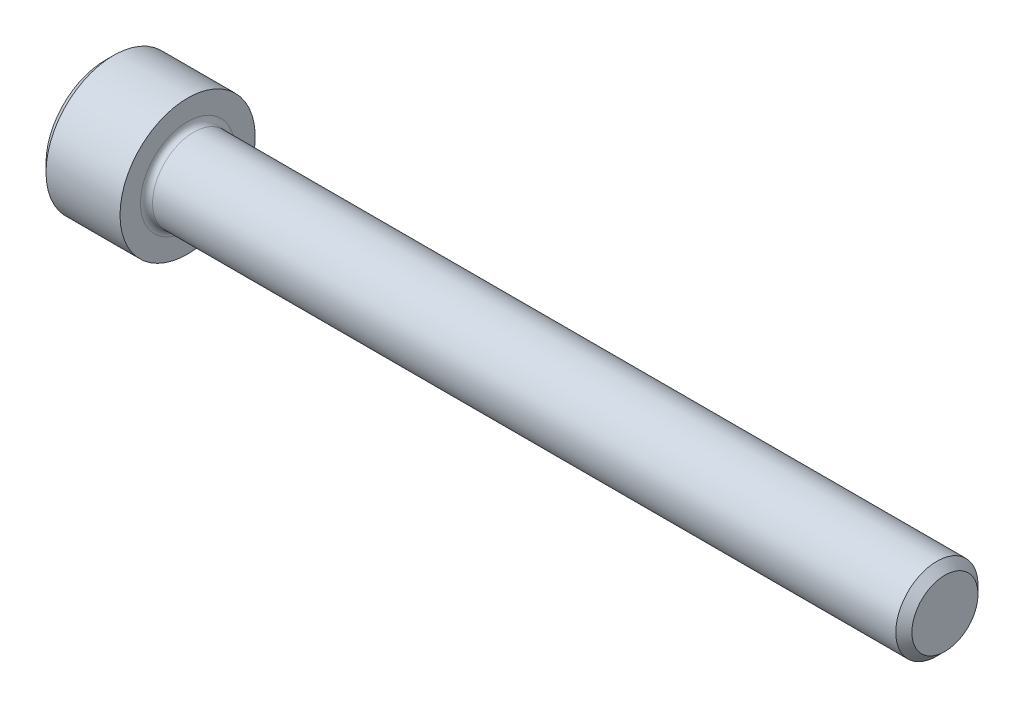
ISO-10303-21;
HEADER;
FILE_DESCRIPTION(('STEP AP214'),'2;1');
FILE_NAME('part.step','',(''),(''),'','','');
FILE_SCHEMA(('AUTOMOTIVE_DESIGN { 1 0 10303 214 1 1 1 1 }'));
ENDSEC;
DATA;
#1=APPLICATION_CONTEXT('core data for automotive mechanical design processes');
#2=APPLICATION_PROTOCOL_DEFINITION('international standard','automotive_design',2000,#1);
#3=PRODUCT_CONTEXT('',#1,'mechanical');
#4=PRODUCT('Part','Part','',(#3));
#5=PRODUCT_RELATED_PRODUCT_CATEGORY('part','',(#4));
#6=PRODUCT_DEFINITION_FORMATION('','',#4);
#7=PRODUCT_DEFINITION_CONTEXT('part definition',#1,'design');
#8=PRODUCT_DEFINITION('design','',#6,#7);
#9=PRODUCT_DEFINITION_SHAPE('','',#8);
#10=(LENGTH_UNIT() NAMED_UNIT(*) SI_UNIT(.MILLI.,.METRE.));
#11=(NAMED_UNIT(*) PLANE_ANGLE_UNIT() SI_UNIT($,.RADIAN.));
#12=(NAMED_UNIT(*) SI_UNIT($,.STERADIAN.) SOLID_ANGLE_UNIT());
#13=UNCERTAINTY_MEASURE_WITH_UNIT(LENGTH_MEASURE(1.E-05),#10,'distance_accuracy_value','');
#14=(GEOMETRIC_REPRESENTATION_CONTEXT(3) GLOBAL_UNCERTAINTY_ASSIGNED_CONTEXT((#13)) GLOBAL_UNIT_ASSIGNED_CONTEXT((#10,
#11,#12)) REPRESENTATION_CONTEXT('',''));
#15=CARTESIAN_POINT('',(0.,0.,0.));
#16=DIRECTION('',(0.,0.,1.));
#17=DIRECTION('',(1.,0.,0.));
#18=AXIS2_PLACEMENT_3D('',#15,#16,#17);
#19=CARTESIAN_POINT('',(0.,0.,0.));
#20=DIRECTION('',(-1.,0.,0.));
#21=DIRECTION('',(0.,0.,1.));
#22=AXIS2_PLACEMENT_3D('',#19,#20,#21);
#23=PLANE('',#22);
#24=DIRECTION('',(0.,-0.499999999999999,0.866025403784439));
#25=VECTOR('',#24,1.);
#26=CARTESIAN_POINT('',(0.,2.2920921156882,0.));
#27=LINE('',#26,#25);
#28=CARTESIAN_POINT('',(0.,2.2920921156882,0.));
#29=VERTEX_POINT('',#28);
#30=CARTESIAN_POINT('',(0.,1.1460460578441,1.98501));
#31=VERTEX_POINT('',#30);
#32=EDGE_CURVE('E388',#29,#31,#27,.T.);
#33=ORIENTED_EDGE('',*,*,#32,.T.);
#34=DIRECTION('',(0.,1.,0.));
#35=VECTOR('',#34,1.);
#36=CARTESIAN_POINT('',(0.,-1.14604605784409,1.98501));
#37=LINE('',#36,#35);
#38=CARTESIAN_POINT('',(0.,-1.14604605784409,1.98501));
#39=VERTEX_POINT('',#38);
#40=EDGE_CURVE('E130',#39,#31,#37,.T.);
#41=ORIENTED_EDGE('',*,*,#40,.F.);
#42=DIRECTION('',(0.,-0.500000000000001,-0.866025403784438));
#43=VECTOR('',#42,1.);
#44=CARTESIAN_POINT('',(0.,-1.14604605784409,1.98501));
#45=LINE('',#44,#43);
#46=CARTESIAN_POINT('',(0.,-2.29209211568819,0.));
#47=VERTEX_POINT('',#46);
#48=EDGE_CURVE('E391',#39,#47,#45,.T.);
#49=ORIENTED_EDGE('',*,*,#48,.T.);
#50=DIRECTION('',(0.,0.499999999999998,-0.86602540378444));
#51=VECTOR('',#50,1.);
#52=CARTESIAN_POINT('',(0.,-2.29209211568819,0.));
#53=LINE('',#52,#51);
#54=CARTESIAN_POINT('',(0.,-1.1460460578441,-1.98501));
#55=VERTEX_POINT('',#54);
#56=EDGE_CURVE('E394',#47,#55,#53,.T.);
#57=ORIENTED_EDGE('',*,*,#56,.T.);
#58=DIRECTION('',(0.,-1.,0.));
#59=VECTOR('',#58,1.);
#60=CARTESIAN_POINT('',(0.,1.1460460578441,-1.98501));
#61=LINE('',#60,#59);
#62=CARTESIAN_POINT('',(0.,1.1460460578441,-1.98501));
#63=VERTEX_POINT('',#62);
#64=EDGE_CURVE('E397',#63,#55,#61,.T.);
#65=ORIENTED_EDGE('',*,*,#64,.F.);
#66=DIRECTION('',(0.,-0.500000000000001,-0.866025403784438));
#67=VECTOR('',#66,1.);
#68=CARTESIAN_POINT('',(0.,2.2920921156882,0.));
#69=LINE('',#68,#67);
#70=EDGE_CURVE('E125',#29,#63,#69,.T.);
#71=ORIENTED_EDGE('',*,*,#70,.F.);
#72=EDGE_LOOP('',(#33,#41,#49,#57,#65,#71));
#73=FACE_BOUND('',#72,.T.);
#74=CARTESIAN_POINT('',(0.,0.,0.));
#75=DIRECTION('',(-1.,0.,0.));
#76=DIRECTION('',(0.,0.,1.));
#77=AXIS2_PLACEMENT_3D('',#74,#75,#76);
#78=CIRCLE('',#77,3.48615000000001);
#79=CARTESIAN_POINT('',(0.,0.,3.48615000000001));
#80=VERTEX_POINT('',#79);
#81=EDGE_CURVE('E141',#80,#80,#78,.T.);
#82=ORIENTED_EDGE('',*,*,#81,.T.);
#83=EDGE_LOOP('',(#82));
#84=FACE_BOUND('',#83,.T.);
#85=ADVANCED_FACE('F34',(#73,#84),#23,.T.);
#86=CARTESIAN_POINT('',(49.276,1.94056,0.));
#87=DIRECTION('',(1.,0.,0.));
#88=DIRECTION('',(0.,0.,-1.));
#89=AXIS2_PLACEMENT_3D('',#86,#87,#88);
#90=PLANE('',#89);
#91=CARTESIAN_POINT('',(49.276,0.,0.));
#92=DIRECTION('',(-1.,0.,0.));
#93=DIRECTION('',(0.,0.,1.));
#94=AXIS2_PLACEMENT_3D('',#91,#92,#93);
#95=CIRCLE('',#94,1.94056);
#96=CARTESIAN_POINT('',(49.276,0.,1.94056));
#97=VERTEX_POINT('',#96);
#98=EDGE_CURVE('E154',#97,#97,#95,.T.);
#99=ORIENTED_EDGE('',*,*,#98,.F.);
#100=EDGE_LOOP('',(#99));
#101=FACE_BOUND('',#100,.T.);
#102=ADVANCED_FACE('F175',(#101),#90,.T.);
#103=CARTESIAN_POINT('',(49.276,0.,0.));
#104=DIRECTION('',(-1.,0.,0.));
#105=DIRECTION('',(0.,0.,1.));
#106=AXIS2_PLACEMENT_3D('',#103,#104,#105);
#107=CONICAL_SURFACE('',#106,1.94056,0.785398163397416);
#108=CARTESIAN_POINT('',(48.80356,0.,0.));
#109=DIRECTION('',(-1.,0.,0.));
#110=DIRECTION('',(0.,0.,1.));
#111=AXIS2_PLACEMENT_3D('',#108,#109,#110);
#112=CIRCLE('',#111,2.41299999999999);
#113=CARTESIAN_POINT('',(48.80356,0.,2.41299999999999));
#114=VERTEX_POINT('',#113);
#115=EDGE_CURVE('E151',#114,#114,#112,.T.);
#116=ORIENTED_EDGE('',*,*,#115,.F.);
#117=EDGE_LOOP('',(#116));
#118=FACE_BOUND('',#117,.T.);
#119=ORIENTED_EDGE('',*,*,#98,.T.);
#120=EDGE_LOOP('',(#119));
#121=FACE_BOUND('',#120,.T.);
#122=ADVANCED_FACE('F181',(#118,#121),#107,.T.);
#123=CARTESIAN_POINT('',(-31.75,0.,0.));
#124=DIRECTION('',(-1.,0.,0.));
#125=DIRECTION('',(0.,0.,1.));
#126=AXIS2_PLACEMENT_3D('',#123,#124,#125);
#127=CYLINDRICAL_SURFACE('',#126,2.41299999999999);
#128=CARTESIAN_POINT('',(5.1816,0.,0.));
#129=DIRECTION('',(1.,0.,0.));
#130=DIRECTION('',(0.,0.,-1.));
#131=AXIS2_PLACEMENT_3D('',#128,#129,#130);
#132=CIRCLE('',#131,2.41299999999999);
#133=CARTESIAN_POINT('',(5.1816,0.,-2.41299999999999));
#134=VERTEX_POINT('',#133);
#135=EDGE_CURVE('E11',#134,#134,#132,.T.);
#136=ORIENTED_EDGE('',*,*,#135,.T.);
#137=EDGE_LOOP('',(#136));
#138=FACE_BOUND('',#137,.T.);
#139=ORIENTED_EDGE('',*,*,#115,.T.);
#140=EDGE_LOOP('',(#139));
#141=FACE_BOUND('',#140,.T.);
#142=ADVANCED_FACE('F192',(#138,#141),#127,.T.);
#143=CARTESIAN_POINT('',(4.826,3.96875,0.));
#144=DIRECTION('',(1.,0.,0.));
#145=DIRECTION('',(0.,0.,-1.));
#146=AXIS2_PLACEMENT_3D('',#143,#144,#145);
#147=PLANE('',#146);
#148=CARTESIAN_POINT('',(4.826,0.,0.));
#149=DIRECTION('',(1.,0.,0.));
#150=DIRECTION('',(0.,0.,-1.));
#151=AXIS2_PLACEMENT_3D('',#148,#149,#150);
#152=CIRCLE('',#151,2.76859999999999);
#153=CARTESIAN_POINT('',(4.826,0.,-2.76859999999999));
#154=VERTEX_POINT('',#153);
#155=EDGE_CURVE('E42',#154,#154,#152,.F.);
#156=ORIENTED_EDGE('',*,*,#155,.T.);
#157=EDGE_LOOP('',(#156));
#158=FACE_BOUND('',#157,.T.);
#159=CARTESIAN_POINT('',(4.826,0.,0.));
#160=DIRECTION('',(-1.,0.,0.));
#161=DIRECTION('',(0.,0.,1.));
#162=AXIS2_PLACEMENT_3D('',#159,#160,#161);
#163=CIRCLE('',#162,3.96875);
#164=CARTESIAN_POINT('',(4.826,0.,3.96875));
#165=VERTEX_POINT('',#164);
#166=EDGE_CURVE('E148',#165,#165,#163,.T.);
#167=ORIENTED_EDGE('',*,*,#166,.F.);
#168=EDGE_LOOP('',(#167));
#169=FACE_BOUND('',#168,.T.);
#170=ADVANCED_FACE('F159',(#158,#169),#147,.T.);
#171=CARTESIAN_POINT('',(-31.75,0.,0.));
#172=DIRECTION('',(-1.,0.,0.));
#173=DIRECTION('',(0.,0.,1.));
#174=AXIS2_PLACEMENT_3D('',#171,#172,#173);
#175=CYLINDRICAL_SURFACE('',#174,3.96875);
#176=ORIENTED_EDGE('',*,*,#166,.T.);
#177=EDGE_LOOP('',(#176));
#178=FACE_BOUND('',#177,.T.);
#179=CARTESIAN_POINT('',(0.4826,0.,0.));
#180=DIRECTION('',(-1.,0.,0.));
#181=DIRECTION('',(0.,0.,1.));
#182=AXIS2_PLACEMENT_3D('',#179,#180,#181);
#183=CIRCLE('',#182,3.96875);
#184=CARTESIAN_POINT('',(0.4826,0.,3.96875));
#185=VERTEX_POINT('',#184);
#186=EDGE_CURVE('E145',#185,#185,#183,.T.);
#187=ORIENTED_EDGE('',*,*,#186,.F.);
#188=EDGE_LOOP('',(#187));
#189=FACE_BOUND('',#188,.T.);
#190=ADVANCED_FACE('F170',(#178,#189),#175,.T.);
#191=CARTESIAN_POINT('',(0.,0.,0.));
#192=DIRECTION('',(1.,0.,0.));
#193=DIRECTION('',(0.,0.,-1.));
#194=AXIS2_PLACEMENT_3D('',#191,#192,#193);
#195=CONICAL_SURFACE('',#194,3.48615000000001,0.785398163397438);
#196=ORIENTED_EDGE('',*,*,#186,.T.);
#197=EDGE_LOOP('',(#196));
#198=FACE_BOUND('',#197,.T.);
#199=ORIENTED_EDGE('',*,*,#81,.F.);
#200=EDGE_LOOP('',(#199));
#201=FACE_BOUND('',#200,.T.);
#202=ADVANCED_FACE('F163',(#198,#201),#195,.T.);
#203=CARTESIAN_POINT('',(5.1816,0.,0.));
#204=DIRECTION('',(1.,0.,0.));
#205=DIRECTION('',(0.,0.,-1.));
#206=AXIS2_PLACEMENT_3D('',#203,#204,#205);
#207=TOROIDAL_SURFACE('',#206,2.76859999999999,0.3556);
#208=ORIENTED_EDGE('',*,*,#135,.F.);
#209=EDGE_LOOP('',(#208));
#210=FACE_BOUND('',#209,.T.);
#211=ORIENTED_EDGE('',*,*,#155,.F.);
#212=EDGE_LOOP('',(#211));
#213=FACE_BOUND('',#212,.T.);
#214=ADVANCED_FACE('F36',(#210,#213),#207,.F.);
#215=CARTESIAN_POINT('',(2.286,2.2920921156882,0.));
#216=DIRECTION('',(0.,-0.866025403784439,-0.499999999999999));
#217=DIRECTION('',(0.,0.499999999999999,-0.866025403784439));
#218=AXIS2_PLACEMENT_3D('',#215,#216,#217);
#219=PLANE('',#218);
#220=ORIENTED_EDGE('',*,*,#32,.F.);
#221=DIRECTION('',(-1.,0.,0.));
#222=VECTOR('',#221,1.);
#223=CARTESIAN_POINT('',(2.286,2.2920921156882,0.));
#224=LINE('',#223,#222);
#225=CARTESIAN_POINT('',(2.286,2.2920921156882,0.));
#226=VERTEX_POINT('',#225);
#227=EDGE_CURVE('E378',#226,#29,#224,.T.);
#228=ORIENTED_EDGE('',*,*,#227,.F.);
#229=DIRECTION('',(0.,-0.499999999999999,0.866025403784439));
#230=VECTOR('',#229,1.);
#231=CARTESIAN_POINT('',(2.286,2.2920921156882,0.));
#232=LINE('',#231,#230);
#233=CARTESIAN_POINT('',(2.286,1.71906908676615,0.992504999999998));
#234=VERTEX_POINT('',#233);
#235=EDGE_CURVE('E117',#226,#234,#232,.T.);
#236=ORIENTED_EDGE('',*,*,#235,.T.);
#237=CARTESIAN_POINT('',(2.286,1.1460460578441,1.98501));
#238=VERTEX_POINT('',#237);
#239=EDGE_CURVE('E108',#234,#238,#232,.T.);
#240=ORIENTED_EDGE('',*,*,#239,.T.);
#241=DIRECTION('',(-1.,0.,0.));
#242=VECTOR('',#241,1.);
#243=CARTESIAN_POINT('',(2.286,1.1460460578441,1.98501));
#244=LINE('',#243,#242);
#245=EDGE_CURVE('E122',#238,#31,#244,.T.);
#246=ORIENTED_EDGE('',*,*,#245,.T.);
#247=EDGE_LOOP('',(#220,#228,#236,#240,#246));
#248=FACE_BOUND('',#247,.T.);
#249=ADVANCED_FACE('F121',(#248),#219,.T.);
#250=CARTESIAN_POINT('',(2.286,-1.14604605784409,1.98501));
#251=DIRECTION('',(0.,0.,1.));
#252=DIRECTION('',(0.,-1.,0.));
#253=AXIS2_PLACEMENT_3D('',#250,#251,#252);
#254=PLANE('',#253);
#255=ORIENTED_EDGE('',*,*,#40,.T.);
#256=ORIENTED_EDGE('',*,*,#245,.F.);
#257=DIRECTION('',(0.,1.,0.));
#258=VECTOR('',#257,1.);
#259=CARTESIAN_POINT('',(2.286,-1.14604605784409,1.98501));
#260=LINE('',#259,#258);
#261=CARTESIAN_POINT('',(2.286,0.,1.98501));
#262=VERTEX_POINT('',#261);
#263=EDGE_CURVE('E105',#262,#238,#260,.T.);
#264=ORIENTED_EDGE('',*,*,#263,.F.);
#265=CARTESIAN_POINT('',(2.286,-1.14604605784409,1.98501));
#266=VERTEX_POINT('',#265);
#267=EDGE_CURVE('E116',#266,#262,#260,.T.);
#268=ORIENTED_EDGE('',*,*,#267,.F.);
#269=DIRECTION('',(-1.,0.,0.));
#270=VECTOR('',#269,1.);
#271=CARTESIAN_POINT('',(2.286,-1.14604605784409,1.98501));
#272=LINE('',#271,#270);
#273=EDGE_CURVE('E132',#266,#39,#272,.T.);
#274=ORIENTED_EDGE('',*,*,#273,.T.);
#275=EDGE_LOOP('',(#255,#256,#264,#268,#274));
#276=FACE_BOUND('',#275,.T.);
#277=ADVANCED_FACE('F127',(#276),#254,.F.);
#278=CARTESIAN_POINT('',(2.286,-1.14604605784409,1.98501));
#279=DIRECTION('',(0.,0.866025403784438,-0.500000000000001));
#280=DIRECTION('',(0.,0.500000000000001,0.866025403784438));
#281=AXIS2_PLACEMENT_3D('',#278,#279,#280);
#282=PLANE('',#281);
#283=ORIENTED_EDGE('',*,*,#48,.F.);
#284=ORIENTED_EDGE('',*,*,#273,.F.);
#285=DIRECTION('',(0.,-0.500000000000001,-0.866025403784438));
#286=VECTOR('',#285,1.);
#287=CARTESIAN_POINT('',(2.286,-1.14604605784409,1.98501));
#288=LINE('',#287,#286);
#289=CARTESIAN_POINT('',(2.286,-1.71906908676614,0.992505000000001));
#290=VERTEX_POINT('',#289);
#291=EDGE_CURVE('E417',#266,#290,#288,.T.);
#292=ORIENTED_EDGE('',*,*,#291,.T.);
#293=CARTESIAN_POINT('',(2.286,-2.29209211568819,0.));
#294=VERTEX_POINT('',#293);
#295=EDGE_CURVE('E406',#290,#294,#288,.T.);
#296=ORIENTED_EDGE('',*,*,#295,.T.);
#297=DIRECTION('',(-1.,0.,0.));
#298=VECTOR('',#297,1.);
#299=CARTESIAN_POINT('',(2.286,-2.29209211568819,0.));
#300=LINE('',#299,#298);
#301=EDGE_CURVE('E137',#294,#47,#300,.T.);
#302=ORIENTED_EDGE('',*,*,#301,.T.);
#303=EDGE_LOOP('',(#283,#284,#292,#296,#302));
#304=FACE_BOUND('',#303,.T.);
#305=ADVANCED_FACE('F269',(#304),#282,.T.);
#306=CARTESIAN_POINT('',(2.286,-2.29209211568819,0.));
#307=DIRECTION('',(0.,0.866025403784439,0.499999999999998));
#308=DIRECTION('',(0.,-0.499999999999998,0.86602540378444));
#309=AXIS2_PLACEMENT_3D('',#306,#307,#308);
#310=PLANE('',#309);
#311=ORIENTED_EDGE('',*,*,#56,.F.);
#312=ORIENTED_EDGE('',*,*,#301,.F.);
#313=DIRECTION('',(0.,0.499999999999998,-0.86602540378444));
#314=VECTOR('',#313,1.);
#315=CARTESIAN_POINT('',(2.286,-2.29209211568819,0.));
#316=LINE('',#315,#314);
#317=CARTESIAN_POINT('',(2.286,-1.71906908676615,-0.992504999999995));
#318=VERTEX_POINT('',#317);
#319=EDGE_CURVE('E384',#294,#318,#316,.T.);
#320=ORIENTED_EDGE('',*,*,#319,.T.);
#321=CARTESIAN_POINT('',(2.286,-1.1460460578441,-1.98501));
#322=VERTEX_POINT('',#321);
#323=EDGE_CURVE('E416',#318,#322,#316,.T.);
#324=ORIENTED_EDGE('',*,*,#323,.T.);
#325=DIRECTION('',(-1.,0.,0.));
#326=VECTOR('',#325,1.);
#327=CARTESIAN_POINT('',(2.286,-1.1460460578441,-1.98501));
#328=LINE('',#327,#326);
#329=EDGE_CURVE('E377',#322,#55,#328,.T.);
#330=ORIENTED_EDGE('',*,*,#329,.T.);
#331=EDGE_LOOP('',(#311,#312,#320,#324,#330));
#332=FACE_BOUND('',#331,.T.);
#333=ADVANCED_FACE('F277',(#332),#310,.T.);
#334=CARTESIAN_POINT('',(2.286,1.1460460578441,-1.98501));
#335=DIRECTION('',(0.,0.,-1.));
#336=DIRECTION('',(0.,1.,0.));
#337=AXIS2_PLACEMENT_3D('',#334,#335,#336);
#338=PLANE('',#337);
#339=ORIENTED_EDGE('',*,*,#64,.T.);
#340=ORIENTED_EDGE('',*,*,#329,.F.);
#341=DIRECTION('',(0.,-1.,0.));
#342=VECTOR('',#341,1.);
#343=CARTESIAN_POINT('',(2.286,1.1460460578441,-1.98501));
#344=LINE('',#343,#342);
#345=CARTESIAN_POINT('',(2.286,0.,-1.98501));
#346=VERTEX_POINT('',#345);
#347=EDGE_CURVE('E381',#346,#322,#344,.T.);
#348=ORIENTED_EDGE('',*,*,#347,.F.);
#349=CARTESIAN_POINT('',(2.286,1.1460460578441,-1.98501));
#350=VERTEX_POINT('',#349);
#351=EDGE_CURVE('E49',#350,#346,#344,.T.);
#352=ORIENTED_EDGE('',*,*,#351,.F.);
#353=DIRECTION('',(-1.,0.,0.));
#354=VECTOR('',#353,1.);
#355=CARTESIAN_POINT('',(2.286,1.1460460578441,-1.98501));
#356=LINE('',#355,#354);
#357=EDGE_CURVE('E374',#350,#63,#356,.T.);
#358=ORIENTED_EDGE('',*,*,#357,.T.);
#359=EDGE_LOOP('',(#339,#340,#348,#352,#358));
#360=FACE_BOUND('',#359,.T.);
#361=ADVANCED_FACE('F286',(#360),#338,.F.);
#362=CARTESIAN_POINT('',(2.286,2.2920921156882,0.));
#363=DIRECTION('',(0.,0.866025403784438,-0.500000000000001));
#364=DIRECTION('',(0.,0.500000000000001,0.866025403784438));
#365=AXIS2_PLACEMENT_3D('',#362,#363,#364);
#366=PLANE('',#365);
#367=ORIENTED_EDGE('',*,*,#70,.T.);
#368=ORIENTED_EDGE('',*,*,#357,.F.);
#369=DIRECTION('',(0.,-0.500000000000001,-0.866025403784438));
#370=VECTOR('',#369,1.);
#371=CARTESIAN_POINT('',(2.286,2.2920921156882,0.));
#372=LINE('',#371,#370);
#373=CARTESIAN_POINT('',(2.286,1.71906908676615,-0.992505000000003));
#374=VERTEX_POINT('',#373);
#375=EDGE_CURVE('E364',#374,#350,#372,.T.);
#376=ORIENTED_EDGE('',*,*,#375,.F.);
#377=EDGE_CURVE('E370',#226,#374,#372,.T.);
#378=ORIENTED_EDGE('',*,*,#377,.F.);
#379=ORIENTED_EDGE('',*,*,#227,.T.);
#380=EDGE_LOOP('',(#367,#368,#376,#378,#379));
#381=FACE_BOUND('',#380,.T.);
#382=ADVANCED_FACE('F295',(#381),#366,.F.);
#383=CARTESIAN_POINT('',(2.286,3.43813817353229,-1.98501));
#384=DIRECTION('',(1.,0.,0.));
#385=DIRECTION('',(0.,0.,-1.));
#386=AXIS2_PLACEMENT_3D('',#383,#384,#385);
#387=PLANE('',#386);
#388=ORIENTED_EDGE('',*,*,#347,.T.);
#389=ORIENTED_EDGE('',*,*,#323,.F.);
#390=CARTESIAN_POINT('',(2.286,0.,0.));
#391=DIRECTION('',(-1.,0.,0.));
#392=DIRECTION('',(0.,0.,1.));
#393=AXIS2_PLACEMENT_3D('',#390,#391,#392);
#394=CIRCLE('',#393,1.98501);
#395=EDGE_CURVE('E412',#346,#318,#394,.T.);
#396=ORIENTED_EDGE('',*,*,#395,.F.);
#397=EDGE_LOOP('',(#388,#389,#396));
#398=FACE_BOUND('',#397,.T.);
#399=ADVANCED_FACE('F304',(#398),#387,.F.);
#400=ORIENTED_EDGE('',*,*,#319,.F.);
#401=ORIENTED_EDGE('',*,*,#295,.F.);
#402=EDGE_CURVE('E135',#318,#290,#394,.T.);
#403=ORIENTED_EDGE('',*,*,#402,.F.);
#404=EDGE_LOOP('',(#400,#401,#403));
#405=FACE_BOUND('',#404,.T.);
#406=ADVANCED_FACE('F313',(#405),#387,.F.);
#407=ORIENTED_EDGE('',*,*,#291,.F.);
#408=ORIENTED_EDGE('',*,*,#267,.T.);
#409=EDGE_CURVE('E131',#290,#262,#394,.T.);
#410=ORIENTED_EDGE('',*,*,#409,.F.);
#411=EDGE_LOOP('',(#407,#408,#410));
#412=FACE_BOUND('',#411,.T.);
#413=ADVANCED_FACE('F322',(#412),#387,.F.);
#414=ORIENTED_EDGE('',*,*,#263,.T.);
#415=ORIENTED_EDGE('',*,*,#239,.F.);
#416=EDGE_CURVE('E111',#262,#234,#394,.T.);
#417=ORIENTED_EDGE('',*,*,#416,.F.);
#418=EDGE_LOOP('',(#414,#415,#417));
#419=FACE_BOUND('',#418,.T.);
#420=ADVANCED_FACE('F107',(#419),#387,.F.);
#421=ORIENTED_EDGE('',*,*,#235,.F.);
#422=ORIENTED_EDGE('',*,*,#377,.T.);
#423=EDGE_CURVE('E142',#234,#374,#394,.T.);
#424=ORIENTED_EDGE('',*,*,#423,.F.);
#425=EDGE_LOOP('',(#421,#422,#424));
#426=FACE_BOUND('',#425,.T.);
#427=ADVANCED_FACE('F337',(#426),#387,.F.);
#428=ORIENTED_EDGE('',*,*,#375,.T.);
#429=ORIENTED_EDGE('',*,*,#351,.T.);
#430=EDGE_CURVE('E367',#374,#346,#394,.T.);
#431=ORIENTED_EDGE('',*,*,#430,.F.);
#432=EDGE_LOOP('',(#428,#429,#431));
#433=FACE_BOUND('',#432,.T.);
#434=ADVANCED_FACE('F252',(#433),#387,.F.);
#435=CARTESIAN_POINT('',(2.286,0.,0.));
#436=DIRECTION('',(-1.,0.,0.));
#437=DIRECTION('',(0.,0.,1.));
#438=AXIS2_PLACEMENT_3D('',#435,#436,#437);
#439=CONICAL_SURFACE('',#438,1.98501,1.04719755119659);
#440=CARTESIAN_POINT('',(3.43204605784411,0.,0.));
#441=VERTEX_POINT('',#440);
#442=VERTEX_LOOP('',#441);
#443=FACE_BOUND('',#442,.T.);
#444=ORIENTED_EDGE('',*,*,#416,.T.);
#445=ORIENTED_EDGE('',*,*,#423,.T.);
#446=ORIENTED_EDGE('',*,*,#430,.T.);
#447=ORIENTED_EDGE('',*,*,#395,.T.);
#448=ORIENTED_EDGE('',*,*,#402,.T.);
#449=ORIENTED_EDGE('',*,*,#409,.T.);
#450=EDGE_LOOP('',(#444,#445,#446,#447,#448,#449));
#451=FACE_BOUND('',#450,.T.);
#452=ADVANCED_FACE('F185',(#443,#451),#439,.F.);
#453=CLOSED_SHELL('',(#85,#102,#122,#142,#170,#190,#202,#214,#249,#277,#305,#333,#361,#382,#399,
#406,#413,#420,#427,#434,#452));
#454=MANIFOLD_SOLID_BREP('B2',#453);
#455=ADVANCED_BREP_SHAPE_REPRESENTATION('',(#18,#454),#14);
#456=SHAPE_DEFINITION_REPRESENTATION(#9,#455);
ENDSEC;
END-ISO-10303-21;
